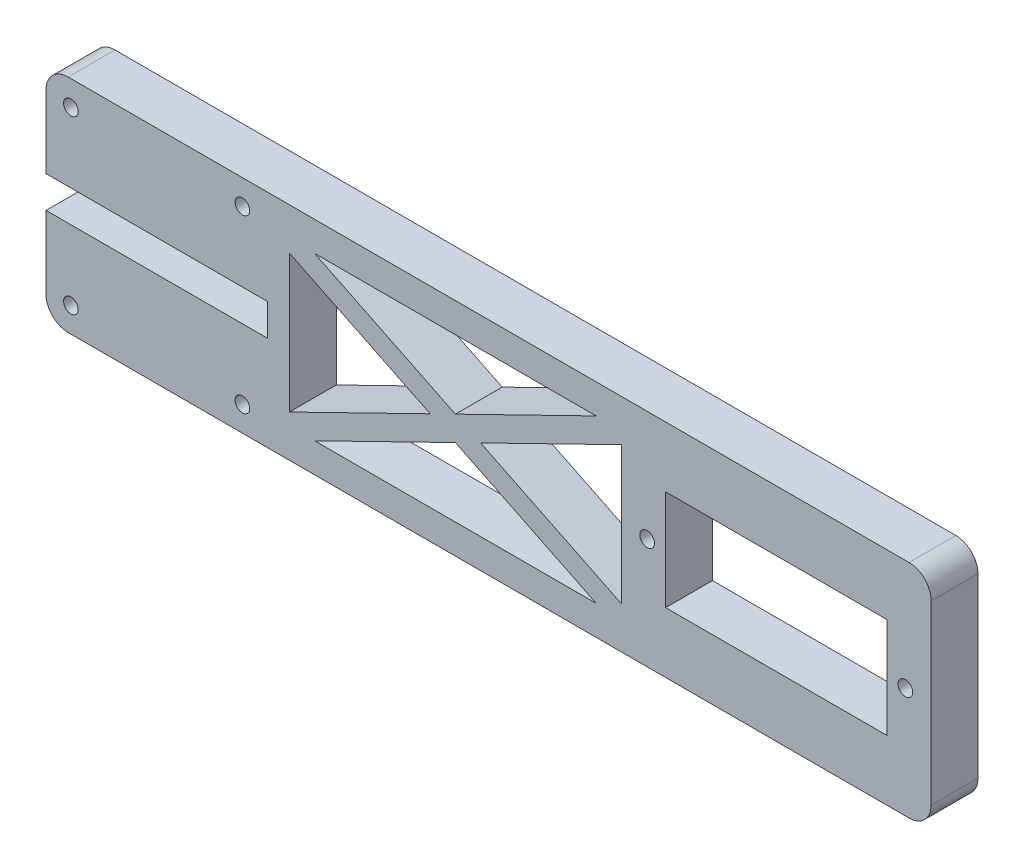
ISO-10303-21;
HEADER;
FILE_DESCRIPTION(('STEP AP214'),'2;1');
FILE_NAME('part.step','',(''),(''),'','','');
FILE_SCHEMA(('AUTOMOTIVE_DESIGN { 1 0 10303 214 1 1 1 1 }'));
ENDSEC;
DATA;
#1=APPLICATION_CONTEXT('core data for automotive mechanical design processes');
#2=APPLICATION_PROTOCOL_DEFINITION('international standard','automotive_design',2000,#1);
#3=PRODUCT_CONTEXT('',#1,'mechanical');
#4=PRODUCT('Part','Part','',(#3));
#5=PRODUCT_RELATED_PRODUCT_CATEGORY('part','',(#4));
#6=PRODUCT_DEFINITION_FORMATION('','',#4);
#7=PRODUCT_DEFINITION_CONTEXT('part definition',#1,'design');
#8=PRODUCT_DEFINITION('design','',#6,#7);
#9=PRODUCT_DEFINITION_SHAPE('','',#8);
#10=(LENGTH_UNIT() NAMED_UNIT(*) SI_UNIT(.MILLI.,.METRE.));
#11=(NAMED_UNIT(*) PLANE_ANGLE_UNIT() SI_UNIT($,.RADIAN.));
#12=(NAMED_UNIT(*) SI_UNIT($,.STERADIAN.) SOLID_ANGLE_UNIT());
#13=UNCERTAINTY_MEASURE_WITH_UNIT(LENGTH_MEASURE(1.E-05),#10,'distance_accuracy_value','');
#14=(GEOMETRIC_REPRESENTATION_CONTEXT(3) GLOBAL_UNCERTAINTY_ASSIGNED_CONTEXT((#13)) GLOBAL_UNIT_ASSIGNED_CONTEXT((#10,
#11,#12)) REPRESENTATION_CONTEXT('',''));
#15=CARTESIAN_POINT('',(0.,0.,0.));
#16=DIRECTION('',(0.,0.,1.));
#17=DIRECTION('',(1.,0.,0.));
#18=AXIS2_PLACEMENT_3D('',#15,#16,#17);
#19=CARTESIAN_POINT('',(0.,0.,6.35));
#20=DIRECTION('',(0.,0.,1.));
#21=DIRECTION('',(1.,0.,0.));
#22=AXIS2_PLACEMENT_3D('',#19,#20,#21);
#23=PLANE('',#22);
#24=DIRECTION('',(0.898384360919201,0.439210132004943,0.));
#25=VECTOR('',#24,1.);
#26=CARTESIAN_POINT('',(33.,5.66966397151576,6.35));
#27=LINE('',#26,#25);
#28=CARTESIAN_POINT('',(33.,5.66966397151576,6.35));
#29=VERTEX_POINT('',#28);
#30=CARTESIAN_POINT('',(52.0847782400814,15.,6.35));
#31=VERTEX_POINT('',#30);
#32=EDGE_CURVE('E251',#29,#31,#27,.T.);
#33=ORIENTED_EDGE('',*,*,#32,.F.);
#34=DIRECTION('',(0.,-1.,0.));
#35=VECTOR('',#34,1.);
#36=CARTESIAN_POINT('',(33.,24.3303360284842,6.35));
#37=LINE('',#36,#35);
#38=CARTESIAN_POINT('',(33.,24.3303360284842,6.35));
#39=VERTEX_POINT('',#38);
#40=EDGE_CURVE('E249',#39,#29,#37,.T.);
#41=ORIENTED_EDGE('',*,*,#40,.F.);
#42=DIRECTION('',(-0.898384360919201,0.439210132004943,0.));
#43=VECTOR('',#42,1.);
#44=CARTESIAN_POINT('',(33.,24.3303360284842,6.35));
#45=LINE('',#44,#43);
#46=EDGE_CURVE('E255',#31,#39,#45,.T.);
#47=ORIENTED_EDGE('',*,*,#46,.F.);
#48=EDGE_LOOP('',(#33,#41,#47));
#49=FACE_BOUND('',#48,.T.);
#50=DIRECTION('',(0.898384360919201,-0.439210132004943,0.));
#51=VECTOR('',#50,1.);
#52=CARTESIAN_POINT('',(36.4152217599186,26.,6.35));
#53=LINE('',#52,#51);
#54=CARTESIAN_POINT('',(36.4152217599186,26.,6.35));
#55=VERTEX_POINT('',#54);
#56=CARTESIAN_POINT('',(55.5,16.6696639715158,6.35));
#57=VERTEX_POINT('',#56);
#58=EDGE_CURVE('E299',#55,#57,#53,.T.);
#59=ORIENTED_EDGE('',*,*,#58,.F.);
#60=DIRECTION('',(-1.,0.,0.));
#61=VECTOR('',#60,1.);
#62=CARTESIAN_POINT('',(36.4152217599186,26.,6.35));
#63=LINE('',#62,#61);
#64=CARTESIAN_POINT('',(74.5847782400814,26.,6.35));
#65=VERTEX_POINT('',#64);
#66=EDGE_CURVE('E297',#65,#55,#63,.T.);
#67=ORIENTED_EDGE('',*,*,#66,.F.);
#68=DIRECTION('',(0.898384360919201,0.439210132004943,0.));
#69=VECTOR('',#68,1.);
#70=CARTESIAN_POINT('',(55.5,16.6696639715158,6.35));
#71=LINE('',#70,#69);
#72=EDGE_CURVE('E303',#57,#65,#71,.T.);
#73=ORIENTED_EDGE('',*,*,#72,.F.);
#74=EDGE_LOOP('',(#59,#67,#73));
#75=FACE_BOUND('',#74,.T.);
#76=CARTESIAN_POINT('',(81.5,15.,6.35));
#77=DIRECTION('',(0.,0.,1.));
#78=DIRECTION('',(1.,0.,0.));
#79=AXIS2_PLACEMENT_3D('',#76,#77,#78);
#80=CIRCLE('',#79,0.996949999999996);
#81=CARTESIAN_POINT('',(82.49695,15.,6.35));
#82=VERTEX_POINT('',#81);
#83=EDGE_CURVE('E320',#82,#82,#80,.T.);
#84=ORIENTED_EDGE('',*,*,#83,.F.);
#85=EDGE_LOOP('',(#84));
#86=FACE_BOUND('',#85,.T.);
#87=CARTESIAN_POINT('',(116.5,15.,6.35));
#88=DIRECTION('',(0.,0.,1.));
#89=DIRECTION('',(1.,0.,0.));
#90=AXIS2_PLACEMENT_3D('',#87,#88,#89);
#91=CIRCLE('',#90,0.996949999999996);
#92=CARTESIAN_POINT('',(117.49695,15.,6.35));
#93=VERTEX_POINT('',#92);
#94=EDGE_CURVE('E324',#93,#93,#91,.T.);
#95=ORIENTED_EDGE('',*,*,#94,.F.);
#96=EDGE_LOOP('',(#95));
#97=FACE_BOUND('',#96,.T.);
#98=CARTESIAN_POINT('',(26.625,26.625,6.35));
#99=DIRECTION('',(0.,0.,1.));
#100=DIRECTION('',(1.,0.,0.));
#101=AXIS2_PLACEMENT_3D('',#98,#99,#100);
#102=CIRCLE('',#101,0.99695);
#103=CARTESIAN_POINT('',(27.62195,26.625,6.35));
#104=VERTEX_POINT('',#103);
#105=EDGE_CURVE('E328',#104,#104,#102,.T.);
#106=ORIENTED_EDGE('',*,*,#105,.F.);
#107=EDGE_LOOP('',(#106));
#108=FACE_BOUND('',#107,.T.);
#109=CARTESIAN_POINT('',(26.625,3.37500000000001,6.35));
#110=DIRECTION('',(0.,0.,1.));
#111=DIRECTION('',(1.,0.,0.));
#112=AXIS2_PLACEMENT_3D('',#109,#110,#111);
#113=CIRCLE('',#112,0.99695);
#114=CARTESIAN_POINT('',(27.62195,3.37500000000001,6.35));
#115=VERTEX_POINT('',#114);
#116=EDGE_CURVE('E334',#115,#115,#113,.T.);
#117=ORIENTED_EDGE('',*,*,#116,.F.);
#118=EDGE_LOOP('',(#117));
#119=FACE_BOUND('',#118,.T.);
#120=CARTESIAN_POINT('',(3.375,3.37500000000001,6.35));
#121=DIRECTION('',(0.,0.,1.));
#122=DIRECTION('',(1.,0.,0.));
#123=AXIS2_PLACEMENT_3D('',#120,#121,#122);
#124=CIRCLE('',#123,0.996949999999999);
#125=CARTESIAN_POINT('',(4.37195,3.37500000000001,6.35));
#126=VERTEX_POINT('',#125);
#127=EDGE_CURVE('E338',#126,#126,#124,.T.);
#128=ORIENTED_EDGE('',*,*,#127,.F.);
#129=EDGE_LOOP('',(#128));
#130=FACE_BOUND('',#129,.T.);
#131=CARTESIAN_POINT('',(3.37500000000001,26.625,6.35));
#132=DIRECTION('',(0.,0.,1.));
#133=DIRECTION('',(1.,0.,0.));
#134=AXIS2_PLACEMENT_3D('',#131,#132,#133);
#135=CIRCLE('',#134,0.996949999999999);
#136=CARTESIAN_POINT('',(4.37195000000001,26.625,6.35));
#137=VERTEX_POINT('',#136);
#138=EDGE_CURVE('E342',#137,#137,#135,.T.);
#139=ORIENTED_EDGE('',*,*,#138,.F.);
#140=EDGE_LOOP('',(#139));
#141=FACE_BOUND('',#140,.T.);
#142=DIRECTION('',(1.,0.,0.));
#143=VECTOR('',#142,1.);
#144=CARTESIAN_POINT('',(0.,0.,6.35));
#145=LINE('',#144,#143);
#146=CARTESIAN_POINT('',(3.,0.,6.35));
#147=VERTEX_POINT('',#146);
#148=CARTESIAN_POINT('',(117.,0.,6.35));
#149=VERTEX_POINT('',#148);
#150=EDGE_CURVE('E381',#147,#149,#145,.T.);
#151=ORIENTED_EDGE('',*,*,#150,.T.);
#152=CARTESIAN_POINT('',(117.,3.,6.35));
#153=DIRECTION('',(0.,0.,1.));
#154=DIRECTION('',(1.,0.,0.));
#155=AXIS2_PLACEMENT_3D('',#152,#153,#154);
#156=CIRCLE('',#155,3.);
#157=CARTESIAN_POINT('',(120.,3.,6.35));
#158=VERTEX_POINT('',#157);
#159=EDGE_CURVE('E463',#149,#158,#156,.T.);
#160=ORIENTED_EDGE('',*,*,#159,.T.);
#161=DIRECTION('',(0.,1.,0.));
#162=VECTOR('',#161,1.);
#163=CARTESIAN_POINT('',(120.,30.,6.35));
#164=LINE('',#163,#162);
#165=CARTESIAN_POINT('',(120.,27.,6.35));
#166=VERTEX_POINT('',#165);
#167=EDGE_CURVE('E385',#158,#166,#164,.T.);
#168=ORIENTED_EDGE('',*,*,#167,.T.);
#169=CARTESIAN_POINT('',(117.,27.,6.35));
#170=DIRECTION('',(0.,0.,1.));
#171=DIRECTION('',(1.,0.,0.));
#172=AXIS2_PLACEMENT_3D('',#169,#170,#171);
#173=CIRCLE('',#172,3.);
#174=CARTESIAN_POINT('',(117.,30.,6.35));
#175=VERTEX_POINT('',#174);
#176=EDGE_CURVE('E461',#166,#175,#173,.T.);
#177=ORIENTED_EDGE('',*,*,#176,.T.);
#178=DIRECTION('',(-1.,0.,0.));
#179=VECTOR('',#178,1.);
#180=CARTESIAN_POINT('',(120.,30.,6.35));
#181=LINE('',#180,#179);
#182=CARTESIAN_POINT('',(3.,30.,6.35));
#183=VERTEX_POINT('',#182);
#184=EDGE_CURVE('E388',#175,#183,#181,.T.);
#185=ORIENTED_EDGE('',*,*,#184,.T.);
#186=CARTESIAN_POINT('',(3.,27.,6.35));
#187=DIRECTION('',(0.,0.,1.));
#188=DIRECTION('',(1.,0.,0.));
#189=AXIS2_PLACEMENT_3D('',#186,#187,#188);
#190=CIRCLE('',#189,3.);
#191=CARTESIAN_POINT('',(0.,27.,6.35));
#192=VERTEX_POINT('',#191);
#193=EDGE_CURVE('E457',#183,#192,#190,.T.);
#194=ORIENTED_EDGE('',*,*,#193,.T.);
#195=DIRECTION('',(0.,-1.,0.));
#196=VECTOR('',#195,1.);
#197=CARTESIAN_POINT('',(0.,30.,6.35));
#198=LINE('',#197,#196);
#199=CARTESIAN_POINT('',(0.,17.159,6.35));
#200=VERTEX_POINT('',#199);
#201=EDGE_CURVE('E391',#192,#200,#198,.T.);
#202=ORIENTED_EDGE('',*,*,#201,.T.);
#203=DIRECTION('',(1.,0.,0.));
#204=VECTOR('',#203,1.);
#205=CARTESIAN_POINT('',(0.,17.159,6.35));
#206=LINE('',#205,#204);
#207=CARTESIAN_POINT('',(30.,17.159,6.35));
#208=VERTEX_POINT('',#207);
#209=EDGE_CURVE('E393',#200,#208,#206,.T.);
#210=ORIENTED_EDGE('',*,*,#209,.T.);
#211=DIRECTION('',(0.,-1.,0.));
#212=VECTOR('',#211,1.);
#213=CARTESIAN_POINT('',(30.,17.159,6.35));
#214=LINE('',#213,#212);
#215=CARTESIAN_POINT('',(30.,12.841,6.35));
#216=VERTEX_POINT('',#215);
#217=EDGE_CURVE('E395',#208,#216,#214,.T.);
#218=ORIENTED_EDGE('',*,*,#217,.T.);
#219=DIRECTION('',(-1.,0.,0.));
#220=VECTOR('',#219,1.);
#221=CARTESIAN_POINT('',(0.,12.841,6.35));
#222=LINE('',#221,#220);
#223=CARTESIAN_POINT('',(0.,12.841,6.35));
#224=VERTEX_POINT('',#223);
#225=EDGE_CURVE('E397',#216,#224,#222,.T.);
#226=ORIENTED_EDGE('',*,*,#225,.T.);
#227=DIRECTION('',(0.,-1.,0.));
#228=VECTOR('',#227,1.);
#229=CARTESIAN_POINT('',(0.,12.841,6.35));
#230=LINE('',#229,#228);
#231=CARTESIAN_POINT('',(0.,3.,6.35));
#232=VERTEX_POINT('',#231);
#233=EDGE_CURVE('E378',#224,#232,#230,.T.);
#234=ORIENTED_EDGE('',*,*,#233,.T.);
#235=CARTESIAN_POINT('',(3.,3.,6.35));
#236=DIRECTION('',(0.,0.,1.));
#237=DIRECTION('',(1.,0.,0.));
#238=AXIS2_PLACEMENT_3D('',#235,#236,#237);
#239=CIRCLE('',#238,3.);
#240=EDGE_CURVE('E459',#232,#147,#239,.T.);
#241=ORIENTED_EDGE('',*,*,#240,.T.);
#242=EDGE_LOOP('',(#151,#160,#168,#177,#185,#194,#202,#210,#218,#226,#234,#241));
#243=FACE_BOUND('',#242,.T.);
#244=DIRECTION('',(1.,0.,0.));
#245=VECTOR('',#244,1.);
#246=CARTESIAN_POINT('',(84.,8.2,6.35));
#247=LINE('',#246,#245);
#248=CARTESIAN_POINT('',(84.,8.2,6.35));
#249=VERTEX_POINT('',#248);
#250=CARTESIAN_POINT('',(114.,8.2,6.35));
#251=VERTEX_POINT('',#250);
#252=EDGE_CURVE('E348',#249,#251,#247,.T.);
#253=ORIENTED_EDGE('',*,*,#252,.F.);
#254=DIRECTION('',(0.,-1.,0.));
#255=VECTOR('',#254,1.);
#256=CARTESIAN_POINT('',(84.,21.8,6.35));
#257=LINE('',#256,#255);
#258=CARTESIAN_POINT('',(84.,21.8,6.35));
#259=VERTEX_POINT('',#258);
#260=EDGE_CURVE('E346',#259,#249,#257,.T.);
#261=ORIENTED_EDGE('',*,*,#260,.F.);
#262=DIRECTION('',(-1.,0.,0.));
#263=VECTOR('',#262,1.);
#264=CARTESIAN_POINT('',(84.,21.8,6.35));
#265=LINE('',#264,#263);
#266=CARTESIAN_POINT('',(114.,21.8,6.35));
#267=VERTEX_POINT('',#266);
#268=EDGE_CURVE('E354',#267,#259,#265,.T.);
#269=ORIENTED_EDGE('',*,*,#268,.F.);
#270=DIRECTION('',(0.,1.,0.));
#271=VECTOR('',#270,1.);
#272=CARTESIAN_POINT('',(114.,21.8,6.35));
#273=LINE('',#272,#271);
#274=EDGE_CURVE('E351',#251,#267,#273,.T.);
#275=ORIENTED_EDGE('',*,*,#274,.F.);
#276=EDGE_LOOP('',(#253,#261,#269,#275));
#277=FACE_BOUND('',#276,.T.);
#278=DIRECTION('',(0.,1.,0.));
#279=VECTOR('',#278,1.);
#280=CARTESIAN_POINT('',(78.,24.3303360284842,6.35));
#281=LINE('',#280,#279);
#282=CARTESIAN_POINT('',(78.,5.66966397151576,6.35));
#283=VERTEX_POINT('',#282);
#284=CARTESIAN_POINT('',(78.,24.3303360284842,6.35));
#285=VERTEX_POINT('',#284);
#286=EDGE_CURVE('E275',#283,#285,#281,.T.);
#287=ORIENTED_EDGE('',*,*,#286,.F.);
#288=DIRECTION('',(0.898384360919201,-0.439210132004943,0.));
#289=VECTOR('',#288,1.);
#290=CARTESIAN_POINT('',(58.9152217599186,15.,6.35));
#291=LINE('',#290,#289);
#292=CARTESIAN_POINT('',(58.9152217599186,15.,6.35));
#293=VERTEX_POINT('',#292);
#294=EDGE_CURVE('E273',#293,#283,#291,.T.);
#295=ORIENTED_EDGE('',*,*,#294,.F.);
#296=DIRECTION('',(-0.898384360919201,-0.439210132004943,0.));
#297=VECTOR('',#296,1.);
#298=CARTESIAN_POINT('',(58.9152217599186,15.,6.35));
#299=LINE('',#298,#297);
#300=EDGE_CURVE('E279',#285,#293,#299,.T.);
#301=ORIENTED_EDGE('',*,*,#300,.F.);
#302=EDGE_LOOP('',(#287,#295,#301));
#303=FACE_BOUND('',#302,.T.);
#304=DIRECTION('',(-0.898384360919201,-0.439210132004943,0.));
#305=VECTOR('',#304,1.);
#306=CARTESIAN_POINT('',(36.4152217599186,4.00000000000001,6.35));
#307=LINE('',#306,#305);
#308=CARTESIAN_POINT('',(55.5,13.3303360284842,6.35));
#309=VERTEX_POINT('',#308);
#310=CARTESIAN_POINT('',(36.4152217599186,4.00000000000001,6.35));
#311=VERTEX_POINT('',#310);
#312=EDGE_CURVE('E230',#309,#311,#307,.T.);
#313=ORIENTED_EDGE('',*,*,#312,.F.);
#314=DIRECTION('',(-0.898384360919201,0.439210132004943,0.));
#315=VECTOR('',#314,1.);
#316=CARTESIAN_POINT('',(55.5,13.3303360284842,6.35));
#317=LINE('',#316,#315);
#318=CARTESIAN_POINT('',(74.5847782400814,4.00000000000001,6.35));
#319=VERTEX_POINT('',#318);
#320=EDGE_CURVE('E222',#319,#309,#317,.T.);
#321=ORIENTED_EDGE('',*,*,#320,.F.);
#322=DIRECTION('',(1.,0.,0.));
#323=VECTOR('',#322,1.);
#324=CARTESIAN_POINT('',(36.4152217599186,4.00000000000001,6.35));
#325=LINE('',#324,#323);
#326=EDGE_CURVE('E239',#311,#319,#325,.T.);
#327=ORIENTED_EDGE('',*,*,#326,.F.);
#328=EDGE_LOOP('',(#313,#321,#327));
#329=FACE_BOUND('',#328,.T.);
#330=ADVANCED_FACE('F37',(#49,#75,#86,#97,#108,#119,#130,#141,#243,#277,#303,#329),#23,.T.);
#331=CARTESIAN_POINT('',(0.,0.,0.));
#332=DIRECTION('',(0.,0.,1.));
#333=DIRECTION('',(1.,0.,0.));
#334=AXIS2_PLACEMENT_3D('',#331,#332,#333);
#335=PLANE('',#334);
#336=DIRECTION('',(0.,-1.,0.));
#337=VECTOR('',#336,1.);
#338=CARTESIAN_POINT('',(33.,24.3303360284842,0.));
#339=LINE('',#338,#337);
#340=CARTESIAN_POINT('',(33.,24.3303360284842,0.));
#341=VERTEX_POINT('',#340);
#342=CARTESIAN_POINT('',(33.,5.66966397151576,0.));
#343=VERTEX_POINT('',#342);
#344=EDGE_CURVE('E237',#341,#343,#339,.T.);
#345=ORIENTED_EDGE('',*,*,#344,.T.);
#346=DIRECTION('',(0.898384360919201,0.439210132004943,0.));
#347=VECTOR('',#346,1.);
#348=CARTESIAN_POINT('',(33.,5.66966397151576,0.));
#349=LINE('',#348,#347);
#350=CARTESIAN_POINT('',(52.0847782400814,15.,0.));
#351=VERTEX_POINT('',#350);
#352=EDGE_CURVE('E260',#343,#351,#349,.T.);
#353=ORIENTED_EDGE('',*,*,#352,.T.);
#354=DIRECTION('',(-0.898384360919201,0.439210132004943,0.));
#355=VECTOR('',#354,1.);
#356=CARTESIAN_POINT('',(33.,24.3303360284842,0.));
#357=LINE('',#356,#355);
#358=EDGE_CURVE('E252',#351,#341,#357,.T.);
#359=ORIENTED_EDGE('',*,*,#358,.T.);
#360=EDGE_LOOP('',(#345,#353,#359));
#361=FACE_BOUND('',#360,.T.);
#362=DIRECTION('',(-1.,0.,0.));
#363=VECTOR('',#362,1.);
#364=CARTESIAN_POINT('',(36.4152217599186,26.,0.));
#365=LINE('',#364,#363);
#366=CARTESIAN_POINT('',(74.5847782400814,26.,0.));
#367=VERTEX_POINT('',#366);
#368=CARTESIAN_POINT('',(36.4152217599186,26.,0.));
#369=VERTEX_POINT('',#368);
#370=EDGE_CURVE('E296',#367,#369,#365,.T.);
#371=ORIENTED_EDGE('',*,*,#370,.T.);
#372=DIRECTION('',(0.898384360919201,-0.439210132004943,0.));
#373=VECTOR('',#372,1.);
#374=CARTESIAN_POINT('',(36.4152217599186,26.,0.));
#375=LINE('',#374,#373);
#376=CARTESIAN_POINT('',(55.5,16.6696639715158,0.));
#377=VERTEX_POINT('',#376);
#378=EDGE_CURVE('E308',#369,#377,#375,.T.);
#379=ORIENTED_EDGE('',*,*,#378,.T.);
#380=DIRECTION('',(0.898384360919201,0.439210132004943,0.));
#381=VECTOR('',#380,1.);
#382=CARTESIAN_POINT('',(55.5,16.6696639715158,0.));
#383=LINE('',#382,#381);
#384=EDGE_CURVE('E300',#377,#367,#383,.T.);
#385=ORIENTED_EDGE('',*,*,#384,.T.);
#386=EDGE_LOOP('',(#371,#379,#385));
#387=FACE_BOUND('',#386,.T.);
#388=CARTESIAN_POINT('',(81.5,15.,0.));
#389=DIRECTION('',(0.,0.,1.));
#390=DIRECTION('',(1.,0.,0.));
#391=AXIS2_PLACEMENT_3D('',#388,#389,#390);
#392=CIRCLE('',#391,0.996949999999996);
#393=CARTESIAN_POINT('',(82.49695,15.,0.));
#394=VERTEX_POINT('',#393);
#395=EDGE_CURVE('E323',#394,#394,#392,.T.);
#396=ORIENTED_EDGE('',*,*,#395,.T.);
#397=EDGE_LOOP('',(#396));
#398=FACE_BOUND('',#397,.T.);
#399=CARTESIAN_POINT('',(116.5,15.,0.));
#400=DIRECTION('',(0.,0.,1.));
#401=DIRECTION('',(1.,0.,0.));
#402=AXIS2_PLACEMENT_3D('',#399,#400,#401);
#403=CIRCLE('',#402,0.996949999999996);
#404=CARTESIAN_POINT('',(117.49695,15.,0.));
#405=VERTEX_POINT('',#404);
#406=EDGE_CURVE('E327',#405,#405,#403,.T.);
#407=ORIENTED_EDGE('',*,*,#406,.T.);
#408=EDGE_LOOP('',(#407));
#409=FACE_BOUND('',#408,.T.);
#410=CARTESIAN_POINT('',(26.625,26.625,0.));
#411=DIRECTION('',(0.,0.,1.));
#412=DIRECTION('',(1.,0.,0.));
#413=AXIS2_PLACEMENT_3D('',#410,#411,#412);
#414=CIRCLE('',#413,0.996949999999998);
#415=CARTESIAN_POINT('',(27.62195,26.625,0.));
#416=VERTEX_POINT('',#415);
#417=EDGE_CURVE('E331',#416,#416,#414,.T.);
#418=ORIENTED_EDGE('',*,*,#417,.T.);
#419=EDGE_LOOP('',(#418));
#420=FACE_BOUND('',#419,.T.);
#421=CARTESIAN_POINT('',(26.625,3.37500000000001,0.));
#422=DIRECTION('',(0.,0.,1.));
#423=DIRECTION('',(1.,0.,0.));
#424=AXIS2_PLACEMENT_3D('',#421,#422,#423);
#425=CIRCLE('',#424,0.996949999999998);
#426=CARTESIAN_POINT('',(27.62195,3.37500000000001,0.));
#427=VERTEX_POINT('',#426);
#428=EDGE_CURVE('E337',#427,#427,#425,.T.);
#429=ORIENTED_EDGE('',*,*,#428,.T.);
#430=EDGE_LOOP('',(#429));
#431=FACE_BOUND('',#430,.T.);
#432=CARTESIAN_POINT('',(3.375,3.37500000000001,0.));
#433=DIRECTION('',(0.,0.,1.));
#434=DIRECTION('',(1.,0.,0.));
#435=AXIS2_PLACEMENT_3D('',#432,#433,#434);
#436=CIRCLE('',#435,0.996949999999999);
#437=CARTESIAN_POINT('',(4.37195,3.37500000000001,0.));
#438=VERTEX_POINT('',#437);
#439=EDGE_CURVE('E341',#438,#438,#436,.T.);
#440=ORIENTED_EDGE('',*,*,#439,.T.);
#441=EDGE_LOOP('',(#440));
#442=FACE_BOUND('',#441,.T.);
#443=CARTESIAN_POINT('',(3.37500000000001,26.625,0.));
#444=DIRECTION('',(0.,0.,1.));
#445=DIRECTION('',(1.,0.,0.));
#446=AXIS2_PLACEMENT_3D('',#443,#444,#445);
#447=CIRCLE('',#446,0.996949999999999);
#448=CARTESIAN_POINT('',(4.37195000000001,26.625,0.));
#449=VERTEX_POINT('',#448);
#450=EDGE_CURVE('E345',#449,#449,#447,.T.);
#451=ORIENTED_EDGE('',*,*,#450,.T.);
#452=EDGE_LOOP('',(#451));
#453=FACE_BOUND('',#452,.T.);
#454=DIRECTION('',(0.,1.,0.));
#455=VECTOR('',#454,1.);
#456=CARTESIAN_POINT('',(120.,30.,0.));
#457=LINE('',#456,#455);
#458=CARTESIAN_POINT('',(120.,3.,0.));
#459=VERTEX_POINT('',#458);
#460=CARTESIAN_POINT('',(120.,27.,0.));
#461=VERTEX_POINT('',#460);
#462=EDGE_CURVE('E405',#459,#461,#457,.T.);
#463=ORIENTED_EDGE('',*,*,#462,.F.);
#464=CARTESIAN_POINT('',(117.,3.,0.));
#465=DIRECTION('',(0.,0.,1.));
#466=DIRECTION('',(1.,0.,0.));
#467=AXIS2_PLACEMENT_3D('',#464,#465,#466);
#468=CIRCLE('',#467,3.);
#469=CARTESIAN_POINT('',(117.,0.,0.));
#470=VERTEX_POINT('',#469);
#471=EDGE_CURVE('E450',#459,#470,#468,.F.);
#472=ORIENTED_EDGE('',*,*,#471,.T.);
#473=DIRECTION('',(1.,0.,0.));
#474=VECTOR('',#473,1.);
#475=CARTESIAN_POINT('',(0.,0.,0.));
#476=LINE('',#475,#474);
#477=CARTESIAN_POINT('',(3.,0.,0.));
#478=VERTEX_POINT('',#477);
#479=EDGE_CURVE('E402',#478,#470,#476,.T.);
#480=ORIENTED_EDGE('',*,*,#479,.F.);
#481=CARTESIAN_POINT('',(3.,3.,0.));
#482=DIRECTION('',(0.,0.,1.));
#483=DIRECTION('',(1.,0.,0.));
#484=AXIS2_PLACEMENT_3D('',#481,#482,#483);
#485=CIRCLE('',#484,3.);
#486=CARTESIAN_POINT('',(0.,3.,0.));
#487=VERTEX_POINT('',#486);
#488=EDGE_CURVE('E446',#478,#487,#485,.F.);
#489=ORIENTED_EDGE('',*,*,#488,.T.);
#490=DIRECTION('',(0.,-1.,0.));
#491=VECTOR('',#490,1.);
#492=CARTESIAN_POINT('',(0.,12.841,0.));
#493=LINE('',#492,#491);
#494=CARTESIAN_POINT('',(0.,12.841,0.));
#495=VERTEX_POINT('',#494);
#496=EDGE_CURVE('E377',#495,#487,#493,.T.);
#497=ORIENTED_EDGE('',*,*,#496,.F.);
#498=DIRECTION('',(-1.,0.,0.));
#499=VECTOR('',#498,1.);
#500=CARTESIAN_POINT('',(0.,12.841,0.));
#501=LINE('',#500,#499);
#502=CARTESIAN_POINT('',(30.,12.841,0.));
#503=VERTEX_POINT('',#502);
#504=EDGE_CURVE('E382',#503,#495,#501,.T.);
#505=ORIENTED_EDGE('',*,*,#504,.F.);
#506=DIRECTION('',(0.,-1.,0.));
#507=VECTOR('',#506,1.);
#508=CARTESIAN_POINT('',(30.,17.159,0.));
#509=LINE('',#508,#507);
#510=CARTESIAN_POINT('',(30.,17.159,0.));
#511=VERTEX_POINT('',#510);
#512=EDGE_CURVE('E415',#511,#503,#509,.T.);
#513=ORIENTED_EDGE('',*,*,#512,.F.);
#514=DIRECTION('',(1.,0.,0.));
#515=VECTOR('',#514,1.);
#516=CARTESIAN_POINT('',(0.,17.159,0.));
#517=LINE('',#516,#515);
#518=CARTESIAN_POINT('',(0.,17.159,0.));
#519=VERTEX_POINT('',#518);
#520=EDGE_CURVE('E413',#519,#511,#517,.T.);
#521=ORIENTED_EDGE('',*,*,#520,.F.);
#522=DIRECTION('',(0.,-1.,0.));
#523=VECTOR('',#522,1.);
#524=CARTESIAN_POINT('',(0.,30.,0.));
#525=LINE('',#524,#523);
#526=CARTESIAN_POINT('',(0.,27.,0.));
#527=VERTEX_POINT('',#526);
#528=EDGE_CURVE('E411',#527,#519,#525,.T.);
#529=ORIENTED_EDGE('',*,*,#528,.F.);
#530=CARTESIAN_POINT('',(3.,27.,0.));
#531=DIRECTION('',(0.,0.,1.));
#532=DIRECTION('',(1.,0.,0.));
#533=AXIS2_PLACEMENT_3D('',#530,#531,#532);
#534=CIRCLE('',#533,3.);
#535=CARTESIAN_POINT('',(3.,30.,0.));
#536=VERTEX_POINT('',#535);
#537=EDGE_CURVE('E444',#527,#536,#534,.F.);
#538=ORIENTED_EDGE('',*,*,#537,.T.);
#539=DIRECTION('',(-1.,0.,0.));
#540=VECTOR('',#539,1.);
#541=CARTESIAN_POINT('',(120.,30.,0.));
#542=LINE('',#541,#540);
#543=CARTESIAN_POINT('',(117.,30.,0.));
#544=VERTEX_POINT('',#543);
#545=EDGE_CURVE('E408',#544,#536,#542,.T.);
#546=ORIENTED_EDGE('',*,*,#545,.F.);
#547=CARTESIAN_POINT('',(117.,27.,0.));
#548=DIRECTION('',(0.,0.,1.));
#549=DIRECTION('',(1.,0.,0.));
#550=AXIS2_PLACEMENT_3D('',#547,#548,#549);
#551=CIRCLE('',#550,3.);
#552=EDGE_CURVE('E448',#544,#461,#551,.F.);
#553=ORIENTED_EDGE('',*,*,#552,.T.);
#554=EDGE_LOOP('',(#463,#472,#480,#489,#497,#505,#513,#521,#529,#538,#546,#553));
#555=FACE_BOUND('',#554,.T.);
#556=DIRECTION('',(0.,-1.,0.));
#557=VECTOR('',#556,1.);
#558=CARTESIAN_POINT('',(84.,21.8,0.));
#559=LINE('',#558,#557);
#560=CARTESIAN_POINT('',(84.,21.8,0.));
#561=VERTEX_POINT('',#560);
#562=CARTESIAN_POINT('',(84.,8.2,0.));
#563=VERTEX_POINT('',#562);
#564=EDGE_CURVE('E357',#561,#563,#559,.T.);
#565=ORIENTED_EDGE('',*,*,#564,.T.);
#566=DIRECTION('',(1.,0.,0.));
#567=VECTOR('',#566,1.);
#568=CARTESIAN_POINT('',(84.,8.2,0.));
#569=LINE('',#568,#567);
#570=CARTESIAN_POINT('',(114.,8.2,0.));
#571=VERTEX_POINT('',#570);
#572=EDGE_CURVE('E360',#563,#571,#569,.T.);
#573=ORIENTED_EDGE('',*,*,#572,.T.);
#574=DIRECTION('',(0.,1.,0.));
#575=VECTOR('',#574,1.);
#576=CARTESIAN_POINT('',(114.,21.8,0.));
#577=LINE('',#576,#575);
#578=CARTESIAN_POINT('',(114.,21.8,0.));
#579=VERTEX_POINT('',#578);
#580=EDGE_CURVE('E363',#571,#579,#577,.T.);
#581=ORIENTED_EDGE('',*,*,#580,.T.);
#582=DIRECTION('',(-1.,0.,0.));
#583=VECTOR('',#582,1.);
#584=CARTESIAN_POINT('',(84.,21.8,0.));
#585=LINE('',#584,#583);
#586=EDGE_CURVE('E349',#579,#561,#585,.T.);
#587=ORIENTED_EDGE('',*,*,#586,.T.);
#588=EDGE_LOOP('',(#565,#573,#581,#587));
#589=FACE_BOUND('',#588,.T.);
#590=DIRECTION('',(0.898384360919201,-0.439210132004943,0.));
#591=VECTOR('',#590,1.);
#592=CARTESIAN_POINT('',(58.9152217599186,15.,0.));
#593=LINE('',#592,#591);
#594=CARTESIAN_POINT('',(58.9152217599186,15.,0.));
#595=VERTEX_POINT('',#594);
#596=CARTESIAN_POINT('',(78.,5.66966397151576,0.));
#597=VERTEX_POINT('',#596);
#598=EDGE_CURVE('E272',#595,#597,#593,.T.);
#599=ORIENTED_EDGE('',*,*,#598,.T.);
#600=DIRECTION('',(0.,1.,0.));
#601=VECTOR('',#600,1.);
#602=CARTESIAN_POINT('',(78.,24.3303360284842,0.));
#603=LINE('',#602,#601);
#604=CARTESIAN_POINT('',(78.,24.3303360284842,0.));
#605=VERTEX_POINT('',#604);
#606=EDGE_CURVE('E284',#597,#605,#603,.T.);
#607=ORIENTED_EDGE('',*,*,#606,.T.);
#608=DIRECTION('',(-0.898384360919201,-0.439210132004943,0.));
#609=VECTOR('',#608,1.);
#610=CARTESIAN_POINT('',(58.9152217599186,15.,0.));
#611=LINE('',#610,#609);
#612=EDGE_CURVE('E276',#605,#595,#611,.T.);
#613=ORIENTED_EDGE('',*,*,#612,.T.);
#614=EDGE_LOOP('',(#599,#607,#613));
#615=FACE_BOUND('',#614,.T.);
#616=DIRECTION('',(-0.898384360919201,0.439210132004943,0.));
#617=VECTOR('',#616,1.);
#618=CARTESIAN_POINT('',(55.5,13.3303360284842,0.));
#619=LINE('',#618,#617);
#620=CARTESIAN_POINT('',(74.5847782400814,4.00000000000001,0.));
#621=VERTEX_POINT('',#620);
#622=CARTESIAN_POINT('',(55.5,13.3303360284842,0.));
#623=VERTEX_POINT('',#622);
#624=EDGE_CURVE('E60',#621,#623,#619,.T.);
#625=ORIENTED_EDGE('',*,*,#624,.T.);
#626=DIRECTION('',(-0.898384360919201,-0.439210132004943,0.));
#627=VECTOR('',#626,1.);
#628=CARTESIAN_POINT('',(36.4152217599186,4.00000000000001,0.));
#629=LINE('',#628,#627);
#630=CARTESIAN_POINT('',(36.4152217599186,4.00000000000001,0.));
#631=VERTEX_POINT('',#630);
#632=EDGE_CURVE('E236',#623,#631,#629,.T.);
#633=ORIENTED_EDGE('',*,*,#632,.T.);
#634=DIRECTION('',(1.,0.,0.));
#635=VECTOR('',#634,1.);
#636=CARTESIAN_POINT('',(36.4152217599186,4.00000000000001,0.));
#637=LINE('',#636,#635);
#638=EDGE_CURVE('E231',#631,#621,#637,.T.);
#639=ORIENTED_EDGE('',*,*,#638,.T.);
#640=EDGE_LOOP('',(#625,#633,#639));
#641=FACE_BOUND('',#640,.T.);
#642=ADVANCED_FACE('F489',(#361,#387,#398,#409,#420,#431,#442,#453,#555,#589,#615,#641),#335,.F.);
#643=CARTESIAN_POINT('',(0.,12.841,6.35));
#644=DIRECTION('',(1.,0.,0.));
#645=DIRECTION('',(0.,0.,-1.));
#646=AXIS2_PLACEMENT_3D('',#643,#644,#645);
#647=PLANE('',#646);
#648=ORIENTED_EDGE('',*,*,#496,.T.);
#649=DIRECTION('',(0.,0.,-1.));
#650=VECTOR('',#649,1.);
#651=CARTESIAN_POINT('',(0.,3.,6.35));
#652=LINE('',#651,#650);
#653=EDGE_CURVE('E45',#487,#232,#652,.F.);
#654=ORIENTED_EDGE('',*,*,#653,.T.);
#655=ORIENTED_EDGE('',*,*,#233,.F.);
#656=DIRECTION('',(0.,0.,-1.));
#657=VECTOR('',#656,1.);
#658=CARTESIAN_POINT('',(0.,12.841,6.35));
#659=LINE('',#658,#657);
#660=EDGE_CURVE('E399',#224,#495,#659,.T.);
#661=ORIENTED_EDGE('',*,*,#660,.T.);
#662=EDGE_LOOP('',(#648,#654,#655,#661));
#663=FACE_BOUND('',#662,.T.);
#664=ADVANCED_FACE('F472',(#663),#647,.F.);
#665=CARTESIAN_POINT('',(0.,0.,6.35));
#666=DIRECTION('',(0.,1.,0.));
#667=DIRECTION('',(0.,0.,1.));
#668=AXIS2_PLACEMENT_3D('',#665,#666,#667);
#669=PLANE('',#668);
#670=ORIENTED_EDGE('',*,*,#479,.T.);
#671=DIRECTION('',(0.,0.,-1.));
#672=VECTOR('',#671,1.);
#673=CARTESIAN_POINT('',(117.,0.,6.35));
#674=LINE('',#673,#672);
#675=EDGE_CURVE('E455',#470,#149,#674,.F.);
#676=ORIENTED_EDGE('',*,*,#675,.T.);
#677=ORIENTED_EDGE('',*,*,#150,.F.);
#678=DIRECTION('',(0.,0.,-1.));
#679=VECTOR('',#678,1.);
#680=CARTESIAN_POINT('',(3.,0.,6.35));
#681=LINE('',#680,#679);
#682=EDGE_CURVE('E452',#147,#478,#681,.T.);
#683=ORIENTED_EDGE('',*,*,#682,.T.);
#684=EDGE_LOOP('',(#670,#676,#677,#683));
#685=FACE_BOUND('',#684,.T.);
#686=ADVANCED_FACE('F485',(#685),#669,.F.);
#687=CARTESIAN_POINT('',(120.,30.,6.35));
#688=DIRECTION('',(-1.,0.,0.));
#689=DIRECTION('',(0.,0.,1.));
#690=AXIS2_PLACEMENT_3D('',#687,#688,#689);
#691=PLANE('',#690);
#692=ORIENTED_EDGE('',*,*,#167,.F.);
#693=DIRECTION('',(0.,0.,-1.));
#694=VECTOR('',#693,1.);
#695=CARTESIAN_POINT('',(120.,3.,6.35));
#696=LINE('',#695,#694);
#697=EDGE_CURVE('E441',#158,#459,#696,.T.);
#698=ORIENTED_EDGE('',*,*,#697,.T.);
#699=ORIENTED_EDGE('',*,*,#462,.T.);
#700=DIRECTION('',(0.,0.,-1.));
#701=VECTOR('',#700,1.);
#702=CARTESIAN_POINT('',(120.,27.,6.35));
#703=LINE('',#702,#701);
#704=EDGE_CURVE('E429',#461,#166,#703,.F.);
#705=ORIENTED_EDGE('',*,*,#704,.T.);
#706=EDGE_LOOP('',(#692,#698,#699,#705));
#707=FACE_BOUND('',#706,.T.);
#708=ADVANCED_FACE('F497',(#707),#691,.F.);
#709=CARTESIAN_POINT('',(120.,30.,6.35));
#710=DIRECTION('',(0.,-1.,0.));
#711=DIRECTION('',(1.,0.,0.));
#712=AXIS2_PLACEMENT_3D('',#709,#710,#711);
#713=PLANE('',#712);
#714=ORIENTED_EDGE('',*,*,#184,.F.);
#715=DIRECTION('',(0.,0.,-1.));
#716=VECTOR('',#715,1.);
#717=CARTESIAN_POINT('',(117.,30.,6.35));
#718=LINE('',#717,#716);
#719=EDGE_CURVE('E467',#175,#544,#718,.T.);
#720=ORIENTED_EDGE('',*,*,#719,.T.);
#721=ORIENTED_EDGE('',*,*,#545,.T.);
#722=DIRECTION('',(0.,0.,-1.));
#723=VECTOR('',#722,1.);
#724=CARTESIAN_POINT('',(3.,30.,6.35));
#725=LINE('',#724,#723);
#726=EDGE_CURVE('E465',#536,#183,#725,.F.);
#727=ORIENTED_EDGE('',*,*,#726,.T.);
#728=EDGE_LOOP('',(#714,#720,#721,#727));
#729=FACE_BOUND('',#728,.T.);
#730=ADVANCED_FACE('F506',(#729),#713,.F.);
#731=CARTESIAN_POINT('',(0.,30.,6.35));
#732=DIRECTION('',(1.,0.,0.));
#733=DIRECTION('',(0.,1.,0.));
#734=AXIS2_PLACEMENT_3D('',#731,#732,#733);
#735=PLANE('',#734);
#736=ORIENTED_EDGE('',*,*,#201,.F.);
#737=DIRECTION('',(0.,0.,-1.));
#738=VECTOR('',#737,1.);
#739=CARTESIAN_POINT('',(0.,27.,6.35));
#740=LINE('',#739,#738);
#741=EDGE_CURVE('E11',#192,#527,#740,.T.);
#742=ORIENTED_EDGE('',*,*,#741,.T.);
#743=ORIENTED_EDGE('',*,*,#528,.T.);
#744=DIRECTION('',(0.,0.,-1.));
#745=VECTOR('',#744,1.);
#746=CARTESIAN_POINT('',(0.,17.159,6.35));
#747=LINE('',#746,#745);
#748=EDGE_CURVE('E426',#200,#519,#747,.T.);
#749=ORIENTED_EDGE('',*,*,#748,.F.);
#750=EDGE_LOOP('',(#736,#742,#743,#749));
#751=FACE_BOUND('',#750,.T.);
#752=ADVANCED_FACE('F515',(#751),#735,.F.);
#753=CARTESIAN_POINT('',(0.,17.159,6.35));
#754=DIRECTION('',(0.,1.,0.));
#755=DIRECTION('',(0.,0.,1.));
#756=AXIS2_PLACEMENT_3D('',#753,#754,#755);
#757=PLANE('',#756);
#758=ORIENTED_EDGE('',*,*,#520,.T.);
#759=DIRECTION('',(0.,0.,-1.));
#760=VECTOR('',#759,1.);
#761=CARTESIAN_POINT('',(30.,17.159,6.35));
#762=LINE('',#761,#760);
#763=EDGE_CURVE('E423',#208,#511,#762,.T.);
#764=ORIENTED_EDGE('',*,*,#763,.F.);
#765=ORIENTED_EDGE('',*,*,#209,.F.);
#766=ORIENTED_EDGE('',*,*,#748,.T.);
#767=EDGE_LOOP('',(#758,#764,#765,#766));
#768=FACE_BOUND('',#767,.T.);
#769=ADVANCED_FACE('F522',(#768),#757,.F.);
#770=CARTESIAN_POINT('',(30.,17.159,6.35));
#771=DIRECTION('',(1.,0.,0.));
#772=DIRECTION('',(0.,0.,-1.));
#773=AXIS2_PLACEMENT_3D('',#770,#771,#772);
#774=PLANE('',#773);
#775=ORIENTED_EDGE('',*,*,#512,.T.);
#776=DIRECTION('',(0.,0.,-1.));
#777=VECTOR('',#776,1.);
#778=CARTESIAN_POINT('',(30.,12.841,6.35));
#779=LINE('',#778,#777);
#780=EDGE_CURVE('E420',#216,#503,#779,.T.);
#781=ORIENTED_EDGE('',*,*,#780,.F.);
#782=ORIENTED_EDGE('',*,*,#217,.F.);
#783=ORIENTED_EDGE('',*,*,#763,.T.);
#784=EDGE_LOOP('',(#775,#781,#782,#783));
#785=FACE_BOUND('',#784,.T.);
#786=ADVANCED_FACE('F525',(#785),#774,.F.);
#787=CARTESIAN_POINT('',(0.,12.841,6.35));
#788=DIRECTION('',(0.,-1.,0.));
#789=DIRECTION('',(0.,0.,-1.));
#790=AXIS2_PLACEMENT_3D('',#787,#788,#789);
#791=PLANE('',#790);
#792=ORIENTED_EDGE('',*,*,#504,.T.);
#793=ORIENTED_EDGE('',*,*,#660,.F.);
#794=ORIENTED_EDGE('',*,*,#225,.F.);
#795=ORIENTED_EDGE('',*,*,#780,.T.);
#796=EDGE_LOOP('',(#792,#793,#794,#795));
#797=FACE_BOUND('',#796,.T.);
#798=ADVANCED_FACE('F528',(#797),#791,.F.);
#799=CARTESIAN_POINT('',(84.,21.8,6.35));
#800=DIRECTION('',(1.,0.,0.));
#801=DIRECTION('',(0.,0.,-1.));
#802=AXIS2_PLACEMENT_3D('',#799,#800,#801);
#803=PLANE('',#802);
#804=ORIENTED_EDGE('',*,*,#564,.F.);
#805=DIRECTION('',(0.,0.,-1.));
#806=VECTOR('',#805,1.);
#807=CARTESIAN_POINT('',(84.,21.8,6.35));
#808=LINE('',#807,#806);
#809=EDGE_CURVE('E356',#259,#561,#808,.T.);
#810=ORIENTED_EDGE('',*,*,#809,.F.);
#811=ORIENTED_EDGE('',*,*,#260,.T.);
#812=DIRECTION('',(0.,0.,-1.));
#813=VECTOR('',#812,1.);
#814=CARTESIAN_POINT('',(84.,8.2,6.35));
#815=LINE('',#814,#813);
#816=EDGE_CURVE('E374',#249,#563,#815,.T.);
#817=ORIENTED_EDGE('',*,*,#816,.T.);
#818=EDGE_LOOP('',(#804,#810,#811,#817));
#819=FACE_BOUND('',#818,.T.);
#820=ADVANCED_FACE('F530',(#819),#803,.T.);
#821=CARTESIAN_POINT('',(84.,8.2,6.35));
#822=DIRECTION('',(0.,1.,0.));
#823=DIRECTION('',(0.,0.,1.));
#824=AXIS2_PLACEMENT_3D('',#821,#822,#823);
#825=PLANE('',#824);
#826=ORIENTED_EDGE('',*,*,#572,.F.);
#827=ORIENTED_EDGE('',*,*,#816,.F.);
#828=ORIENTED_EDGE('',*,*,#252,.T.);
#829=DIRECTION('',(0.,0.,-1.));
#830=VECTOR('',#829,1.);
#831=CARTESIAN_POINT('',(114.,8.2,6.35));
#832=LINE('',#831,#830);
#833=EDGE_CURVE('E372',#251,#571,#832,.T.);
#834=ORIENTED_EDGE('',*,*,#833,.T.);
#835=EDGE_LOOP('',(#826,#827,#828,#834));
#836=FACE_BOUND('',#835,.T.);
#837=ADVANCED_FACE('F536',(#836),#825,.T.);
#838=CARTESIAN_POINT('',(114.,21.8,6.35));
#839=DIRECTION('',(-1.,0.,0.));
#840=DIRECTION('',(0.,0.,1.));
#841=AXIS2_PLACEMENT_3D('',#838,#839,#840);
#842=PLANE('',#841);
#843=ORIENTED_EDGE('',*,*,#580,.F.);
#844=ORIENTED_EDGE('',*,*,#833,.F.);
#845=ORIENTED_EDGE('',*,*,#274,.T.);
#846=DIRECTION('',(0.,0.,-1.));
#847=VECTOR('',#846,1.);
#848=CARTESIAN_POINT('',(114.,21.8,6.35));
#849=LINE('',#848,#847);
#850=EDGE_CURVE('E370',#267,#579,#849,.T.);
#851=ORIENTED_EDGE('',*,*,#850,.T.);
#852=EDGE_LOOP('',(#843,#844,#845,#851));
#853=FACE_BOUND('',#852,.T.);
#854=ADVANCED_FACE('F553',(#853),#842,.T.);
#855=CARTESIAN_POINT('',(84.,21.8,6.35));
#856=DIRECTION('',(0.,-1.,0.));
#857=DIRECTION('',(0.,0.,-1.));
#858=AXIS2_PLACEMENT_3D('',#855,#856,#857);
#859=PLANE('',#858);
#860=ORIENTED_EDGE('',*,*,#586,.F.);
#861=ORIENTED_EDGE('',*,*,#850,.F.);
#862=ORIENTED_EDGE('',*,*,#268,.T.);
#863=ORIENTED_EDGE('',*,*,#809,.T.);
#864=EDGE_LOOP('',(#860,#861,#862,#863));
#865=FACE_BOUND('',#864,.T.);
#866=ADVANCED_FACE('F557',(#865),#859,.T.);
#867=CARTESIAN_POINT('',(3.37500000000001,26.625,6.35));
#868=DIRECTION('',(0.,0.,1.));
#869=DIRECTION('',(1.,0.,0.));
#870=AXIS2_PLACEMENT_3D('',#867,#868,#869);
#871=CYLINDRICAL_SURFACE('',#870,0.996949999999999);
#872=ORIENTED_EDGE('',*,*,#138,.T.);
#873=EDGE_LOOP('',(#872));
#874=FACE_BOUND('',#873,.T.);
#875=ORIENTED_EDGE('',*,*,#450,.F.);
#876=EDGE_LOOP('',(#875));
#877=FACE_BOUND('',#876,.T.);
#878=ADVANCED_FACE('F561',(#874,#877),#871,.F.);
#879=CARTESIAN_POINT('',(3.375,3.37500000000001,6.35));
#880=DIRECTION('',(0.,0.,1.));
#881=DIRECTION('',(1.,0.,0.));
#882=AXIS2_PLACEMENT_3D('',#879,#880,#881);
#883=CYLINDRICAL_SURFACE('',#882,0.996949999999999);
#884=ORIENTED_EDGE('',*,*,#127,.T.);
#885=EDGE_LOOP('',(#884));
#886=FACE_BOUND('',#885,.T.);
#887=ORIENTED_EDGE('',*,*,#439,.F.);
#888=EDGE_LOOP('',(#887));
#889=FACE_BOUND('',#888,.T.);
#890=ADVANCED_FACE('F565',(#886,#889),#883,.F.);
#891=CARTESIAN_POINT('',(26.625,3.37500000000001,6.35));
#892=DIRECTION('',(0.,0.,1.));
#893=DIRECTION('',(1.,0.,0.));
#894=AXIS2_PLACEMENT_3D('',#891,#892,#893);
#895=CYLINDRICAL_SURFACE('',#894,0.996949999999998);
#896=ORIENTED_EDGE('',*,*,#116,.T.);
#897=EDGE_LOOP('',(#896));
#898=FACE_BOUND('',#897,.T.);
#899=ORIENTED_EDGE('',*,*,#428,.F.);
#900=EDGE_LOOP('',(#899));
#901=FACE_BOUND('',#900,.T.);
#902=ADVANCED_FACE('F569',(#898,#901),#895,.F.);
#903=CARTESIAN_POINT('',(26.625,26.625,6.35));
#904=DIRECTION('',(0.,0.,1.));
#905=DIRECTION('',(1.,0.,0.));
#906=AXIS2_PLACEMENT_3D('',#903,#904,#905);
#907=CYLINDRICAL_SURFACE('',#906,0.996949999999998);
#908=ORIENTED_EDGE('',*,*,#105,.T.);
#909=EDGE_LOOP('',(#908));
#910=FACE_BOUND('',#909,.T.);
#911=ORIENTED_EDGE('',*,*,#417,.F.);
#912=EDGE_LOOP('',(#911));
#913=FACE_BOUND('',#912,.T.);
#914=ADVANCED_FACE('F573',(#910,#913),#907,.F.);
#915=CARTESIAN_POINT('',(116.5,15.,6.35));
#916=DIRECTION('',(0.,0.,1.));
#917=DIRECTION('',(1.,0.,0.));
#918=AXIS2_PLACEMENT_3D('',#915,#916,#917);
#919=CYLINDRICAL_SURFACE('',#918,0.996949999999996);
#920=ORIENTED_EDGE('',*,*,#94,.T.);
#921=EDGE_LOOP('',(#920));
#922=FACE_BOUND('',#921,.T.);
#923=ORIENTED_EDGE('',*,*,#406,.F.);
#924=EDGE_LOOP('',(#923));
#925=FACE_BOUND('',#924,.T.);
#926=ADVANCED_FACE('F577',(#922,#925),#919,.F.);
#927=CARTESIAN_POINT('',(81.5,15.,6.35));
#928=DIRECTION('',(0.,0.,1.));
#929=DIRECTION('',(1.,0.,0.));
#930=AXIS2_PLACEMENT_3D('',#927,#928,#929);
#931=CYLINDRICAL_SURFACE('',#930,0.996949999999996);
#932=ORIENTED_EDGE('',*,*,#83,.T.);
#933=EDGE_LOOP('',(#932));
#934=FACE_BOUND('',#933,.T.);
#935=ORIENTED_EDGE('',*,*,#395,.F.);
#936=EDGE_LOOP('',(#935));
#937=FACE_BOUND('',#936,.T.);
#938=ADVANCED_FACE('F581',(#934,#937),#931,.F.);
#939=CARTESIAN_POINT('',(117.,3.,6.35));
#940=DIRECTION('',(0.,0.,-1.));
#941=DIRECTION('',(-1.,0.,0.));
#942=AXIS2_PLACEMENT_3D('',#939,#940,#941);
#943=CYLINDRICAL_SURFACE('',#942,3.);
#944=ORIENTED_EDGE('',*,*,#159,.F.);
#945=ORIENTED_EDGE('',*,*,#675,.F.);
#946=ORIENTED_EDGE('',*,*,#471,.F.);
#947=ORIENTED_EDGE('',*,*,#697,.F.);
#948=EDGE_LOOP('',(#944,#945,#946,#947));
#949=FACE_BOUND('',#948,.T.);
#950=ADVANCED_FACE('F494',(#949),#943,.T.);
#951=CARTESIAN_POINT('',(117.,27.,6.35));
#952=DIRECTION('',(0.,0.,-1.));
#953=DIRECTION('',(-1.,0.,0.));
#954=AXIS2_PLACEMENT_3D('',#951,#952,#953);
#955=CYLINDRICAL_SURFACE('',#954,3.);
#956=ORIENTED_EDGE('',*,*,#176,.F.);
#957=ORIENTED_EDGE('',*,*,#704,.F.);
#958=ORIENTED_EDGE('',*,*,#552,.F.);
#959=ORIENTED_EDGE('',*,*,#719,.F.);
#960=EDGE_LOOP('',(#956,#957,#958,#959));
#961=FACE_BOUND('',#960,.T.);
#962=ADVANCED_FACE('F503',(#961),#955,.T.);
#963=CARTESIAN_POINT('',(3.,3.,6.35));
#964=DIRECTION('',(0.,0.,-1.));
#965=DIRECTION('',(-1.,0.,0.));
#966=AXIS2_PLACEMENT_3D('',#963,#964,#965);
#967=CYLINDRICAL_SURFACE('',#966,3.);
#968=ORIENTED_EDGE('',*,*,#240,.F.);
#969=ORIENTED_EDGE('',*,*,#653,.F.);
#970=ORIENTED_EDGE('',*,*,#488,.F.);
#971=ORIENTED_EDGE('',*,*,#682,.F.);
#972=EDGE_LOOP('',(#968,#969,#970,#971));
#973=FACE_BOUND('',#972,.T.);
#974=ADVANCED_FACE('F482',(#973),#967,.T.);
#975=CARTESIAN_POINT('',(3.,27.,6.35));
#976=DIRECTION('',(0.,0.,-1.));
#977=DIRECTION('',(-1.,0.,0.));
#978=AXIS2_PLACEMENT_3D('',#975,#976,#977);
#979=CYLINDRICAL_SURFACE('',#978,3.);
#980=ORIENTED_EDGE('',*,*,#193,.F.);
#981=ORIENTED_EDGE('',*,*,#726,.F.);
#982=ORIENTED_EDGE('',*,*,#537,.F.);
#983=ORIENTED_EDGE('',*,*,#741,.F.);
#984=EDGE_LOOP('',(#980,#981,#982,#983));
#985=FACE_BOUND('',#984,.T.);
#986=ADVANCED_FACE('F39',(#985),#979,.T.);
#987=CARTESIAN_POINT('',(36.4152217599186,26.,6.35));
#988=DIRECTION('',(0.,-1.,0.));
#989=DIRECTION('',(0.,0.,-1.));
#990=AXIS2_PLACEMENT_3D('',#987,#988,#989);
#991=PLANE('',#990);
#992=ORIENTED_EDGE('',*,*,#370,.F.);
#993=DIRECTION('',(0.,0.,-1.));
#994=VECTOR('',#993,1.);
#995=CARTESIAN_POINT('',(74.5847782400814,26.,6.35));
#996=LINE('',#995,#994);
#997=EDGE_CURVE('E305',#65,#367,#996,.T.);
#998=ORIENTED_EDGE('',*,*,#997,.F.);
#999=ORIENTED_EDGE('',*,*,#66,.T.);
#1000=DIRECTION('',(0.,0.,-1.));
#1001=VECTOR('',#1000,1.);
#1002=CARTESIAN_POINT('',(36.4152217599186,26.,6.35));
#1003=LINE('',#1002,#1001);
#1004=EDGE_CURVE('E317',#55,#369,#1003,.T.);
#1005=ORIENTED_EDGE('',*,*,#1004,.T.);
#1006=EDGE_LOOP('',(#992,#998,#999,#1005));
#1007=FACE_BOUND('',#1006,.T.);
#1008=ADVANCED_FACE('F586',(#1007),#991,.T.);
#1009=CARTESIAN_POINT('',(36.4152217599186,26.,6.35));
#1010=DIRECTION('',(0.439210132004943,0.898384360919201,0.));
#1011=DIRECTION('',(-0.898384360919201,0.439210132004943,0.));
#1012=AXIS2_PLACEMENT_3D('',#1009,#1010,#1011);
#1013=PLANE('',#1012);
#1014=ORIENTED_EDGE('',*,*,#378,.F.);
#1015=ORIENTED_EDGE('',*,*,#1004,.F.);
#1016=ORIENTED_EDGE('',*,*,#58,.T.);
#1017=DIRECTION('',(0.,0.,-1.));
#1018=VECTOR('',#1017,1.);
#1019=CARTESIAN_POINT('',(55.5,16.6696639715158,6.35));
#1020=LINE('',#1019,#1018);
#1021=EDGE_CURVE('E315',#57,#377,#1020,.T.);
#1022=ORIENTED_EDGE('',*,*,#1021,.T.);
#1023=EDGE_LOOP('',(#1014,#1015,#1016,#1022));
#1024=FACE_BOUND('',#1023,.T.);
#1025=ADVANCED_FACE('F589',(#1024),#1013,.T.);
#1026=CARTESIAN_POINT('',(55.5,16.6696639715158,6.35));
#1027=DIRECTION('',(-0.439210132004943,0.898384360919201,0.));
#1028=DIRECTION('',(-0.898384360919201,-0.439210132004943,0.));
#1029=AXIS2_PLACEMENT_3D('',#1026,#1027,#1028);
#1030=PLANE('',#1029);
#1031=ORIENTED_EDGE('',*,*,#384,.F.);
#1032=ORIENTED_EDGE('',*,*,#1021,.F.);
#1033=ORIENTED_EDGE('',*,*,#72,.T.);
#1034=ORIENTED_EDGE('',*,*,#997,.T.);
#1035=EDGE_LOOP('',(#1031,#1032,#1033,#1034));
#1036=FACE_BOUND('',#1035,.T.);
#1037=ADVANCED_FACE('F593',(#1036),#1030,.T.);
#1038=CARTESIAN_POINT('',(58.9152217599186,15.,6.35));
#1039=DIRECTION('',(0.439210132004943,0.898384360919201,0.));
#1040=DIRECTION('',(-0.898384360919201,0.439210132004943,0.));
#1041=AXIS2_PLACEMENT_3D('',#1038,#1039,#1040);
#1042=PLANE('',#1041);
#1043=ORIENTED_EDGE('',*,*,#598,.F.);
#1044=DIRECTION('',(0.,0.,-1.));
#1045=VECTOR('',#1044,1.);
#1046=CARTESIAN_POINT('',(58.9152217599186,15.,6.35));
#1047=LINE('',#1046,#1045);
#1048=EDGE_CURVE('E281',#293,#595,#1047,.T.);
#1049=ORIENTED_EDGE('',*,*,#1048,.F.);
#1050=ORIENTED_EDGE('',*,*,#294,.T.);
#1051=DIRECTION('',(0.,0.,-1.));
#1052=VECTOR('',#1051,1.);
#1053=CARTESIAN_POINT('',(78.,5.66966397151576,6.35));
#1054=LINE('',#1053,#1052);
#1055=EDGE_CURVE('E293',#283,#597,#1054,.T.);
#1056=ORIENTED_EDGE('',*,*,#1055,.T.);
#1057=EDGE_LOOP('',(#1043,#1049,#1050,#1056));
#1058=FACE_BOUND('',#1057,.T.);
#1059=ADVANCED_FACE('F597',(#1058),#1042,.T.);
#1060=CARTESIAN_POINT('',(78.,24.3303360284842,6.35));
#1061=DIRECTION('',(-1.,0.,0.));
#1062=DIRECTION('',(0.,0.,1.));
#1063=AXIS2_PLACEMENT_3D('',#1060,#1061,#1062);
#1064=PLANE('',#1063);
#1065=ORIENTED_EDGE('',*,*,#606,.F.);
#1066=ORIENTED_EDGE('',*,*,#1055,.F.);
#1067=ORIENTED_EDGE('',*,*,#286,.T.);
#1068=DIRECTION('',(0.,0.,-1.));
#1069=VECTOR('',#1068,1.);
#1070=CARTESIAN_POINT('',(78.,24.3303360284842,6.35));
#1071=LINE('',#1070,#1069);
#1072=EDGE_CURVE('E291',#285,#605,#1071,.T.);
#1073=ORIENTED_EDGE('',*,*,#1072,.T.);
#1074=EDGE_LOOP('',(#1065,#1066,#1067,#1073));
#1075=FACE_BOUND('',#1074,.T.);
#1076=ADVANCED_FACE('F601',(#1075),#1064,.T.);
#1077=CARTESIAN_POINT('',(58.9152217599186,15.,6.35));
#1078=DIRECTION('',(0.439210132004943,-0.898384360919201,0.));
#1079=DIRECTION('',(0.898384360919201,0.439210132004943,0.));
#1080=AXIS2_PLACEMENT_3D('',#1077,#1078,#1079);
#1081=PLANE('',#1080);
#1082=ORIENTED_EDGE('',*,*,#612,.F.);
#1083=ORIENTED_EDGE('',*,*,#1072,.F.);
#1084=ORIENTED_EDGE('',*,*,#300,.T.);
#1085=ORIENTED_EDGE('',*,*,#1048,.T.);
#1086=EDGE_LOOP('',(#1082,#1083,#1084,#1085));
#1087=FACE_BOUND('',#1086,.T.);
#1088=ADVANCED_FACE('F605',(#1087),#1081,.T.);
#1089=CARTESIAN_POINT('',(33.,24.3303360284842,6.35));
#1090=DIRECTION('',(1.,0.,0.));
#1091=DIRECTION('',(0.,0.,-1.));
#1092=AXIS2_PLACEMENT_3D('',#1089,#1090,#1091);
#1093=PLANE('',#1092);
#1094=ORIENTED_EDGE('',*,*,#344,.F.);
#1095=DIRECTION('',(0.,0.,-1.));
#1096=VECTOR('',#1095,1.);
#1097=CARTESIAN_POINT('',(33.,24.3303360284842,6.35));
#1098=LINE('',#1097,#1096);
#1099=EDGE_CURVE('E257',#39,#341,#1098,.T.);
#1100=ORIENTED_EDGE('',*,*,#1099,.F.);
#1101=ORIENTED_EDGE('',*,*,#40,.T.);
#1102=DIRECTION('',(0.,0.,-1.));
#1103=VECTOR('',#1102,1.);
#1104=CARTESIAN_POINT('',(33.,5.66966397151576,6.35));
#1105=LINE('',#1104,#1103);
#1106=EDGE_CURVE('E269',#29,#343,#1105,.T.);
#1107=ORIENTED_EDGE('',*,*,#1106,.T.);
#1108=EDGE_LOOP('',(#1094,#1100,#1101,#1107));
#1109=FACE_BOUND('',#1108,.T.);
#1110=ADVANCED_FACE('F609',(#1109),#1093,.T.);
#1111=CARTESIAN_POINT('',(33.,5.66966397151576,6.35));
#1112=DIRECTION('',(-0.439210132004943,0.898384360919201,0.));
#1113=DIRECTION('',(-0.898384360919201,-0.439210132004943,0.));
#1114=AXIS2_PLACEMENT_3D('',#1111,#1112,#1113);
#1115=PLANE('',#1114);
#1116=ORIENTED_EDGE('',*,*,#352,.F.);
#1117=ORIENTED_EDGE('',*,*,#1106,.F.);
#1118=ORIENTED_EDGE('',*,*,#32,.T.);
#1119=DIRECTION('',(0.,0.,-1.));
#1120=VECTOR('',#1119,1.);
#1121=CARTESIAN_POINT('',(52.0847782400814,15.,6.35));
#1122=LINE('',#1121,#1120);
#1123=EDGE_CURVE('E267',#31,#351,#1122,.T.);
#1124=ORIENTED_EDGE('',*,*,#1123,.T.);
#1125=EDGE_LOOP('',(#1116,#1117,#1118,#1124));
#1126=FACE_BOUND('',#1125,.T.);
#1127=ADVANCED_FACE('F613',(#1126),#1115,.T.);
#1128=CARTESIAN_POINT('',(33.,24.3303360284842,6.35));
#1129=DIRECTION('',(-0.439210132004943,-0.898384360919201,0.));
#1130=DIRECTION('',(0.898384360919201,-0.439210132004943,0.));
#1131=AXIS2_PLACEMENT_3D('',#1128,#1129,#1130);
#1132=PLANE('',#1131);
#1133=ORIENTED_EDGE('',*,*,#358,.F.);
#1134=ORIENTED_EDGE('',*,*,#1123,.F.);
#1135=ORIENTED_EDGE('',*,*,#46,.T.);
#1136=ORIENTED_EDGE('',*,*,#1099,.T.);
#1137=EDGE_LOOP('',(#1133,#1134,#1135,#1136));
#1138=FACE_BOUND('',#1137,.T.);
#1139=ADVANCED_FACE('F617',(#1138),#1132,.T.);
#1140=CARTESIAN_POINT('',(55.5,13.3303360284842,6.35));
#1141=DIRECTION('',(-0.439210132004943,-0.898384360919201,0.));
#1142=DIRECTION('',(0.898384360919201,-0.439210132004943,0.));
#1143=AXIS2_PLACEMENT_3D('',#1140,#1141,#1142);
#1144=PLANE('',#1143);
#1145=ORIENTED_EDGE('',*,*,#624,.F.);
#1146=DIRECTION('',(0.,0.,-1.));
#1147=VECTOR('',#1146,1.);
#1148=CARTESIAN_POINT('',(74.5847782400814,4.00000000000001,6.35));
#1149=LINE('',#1148,#1147);
#1150=EDGE_CURVE('E226',#319,#621,#1149,.T.);
#1151=ORIENTED_EDGE('',*,*,#1150,.F.);
#1152=ORIENTED_EDGE('',*,*,#320,.T.);
#1153=DIRECTION('',(0.,0.,-1.));
#1154=VECTOR('',#1153,1.);
#1155=CARTESIAN_POINT('',(55.5,13.3303360284842,6.35));
#1156=LINE('',#1155,#1154);
#1157=EDGE_CURVE('E225',#309,#623,#1156,.T.);
#1158=ORIENTED_EDGE('',*,*,#1157,.T.);
#1159=EDGE_LOOP('',(#1145,#1151,#1152,#1158));
#1160=FACE_BOUND('',#1159,.T.);
#1161=ADVANCED_FACE('F224',(#1160),#1144,.T.);
#1162=CARTESIAN_POINT('',(36.4152217599186,4.00000000000001,6.35));
#1163=DIRECTION('',(0.439210132004943,-0.898384360919201,0.));
#1164=DIRECTION('',(0.898384360919201,0.439210132004943,0.));
#1165=AXIS2_PLACEMENT_3D('',#1162,#1163,#1164);
#1166=PLANE('',#1165);
#1167=ORIENTED_EDGE('',*,*,#632,.F.);
#1168=ORIENTED_EDGE('',*,*,#1157,.F.);
#1169=ORIENTED_EDGE('',*,*,#312,.T.);
#1170=DIRECTION('',(0.,0.,-1.));
#1171=VECTOR('',#1170,1.);
#1172=CARTESIAN_POINT('',(36.4152217599186,4.00000000000001,6.35));
#1173=LINE('',#1172,#1171);
#1174=EDGE_CURVE('E52',#311,#631,#1173,.T.);
#1175=ORIENTED_EDGE('',*,*,#1174,.T.);
#1176=EDGE_LOOP('',(#1167,#1168,#1169,#1175));
#1177=FACE_BOUND('',#1176,.T.);
#1178=ADVANCED_FACE('F234',(#1177),#1166,.T.);
#1179=CARTESIAN_POINT('',(36.4152217599186,4.00000000000001,6.35));
#1180=DIRECTION('',(0.,1.,0.));
#1181=DIRECTION('',(0.,0.,1.));
#1182=AXIS2_PLACEMENT_3D('',#1179,#1180,#1181);
#1183=PLANE('',#1182);
#1184=ORIENTED_EDGE('',*,*,#638,.F.);
#1185=ORIENTED_EDGE('',*,*,#1174,.F.);
#1186=ORIENTED_EDGE('',*,*,#326,.T.);
#1187=ORIENTED_EDGE('',*,*,#1150,.T.);
#1188=EDGE_LOOP('',(#1184,#1185,#1186,#1187));
#1189=FACE_BOUND('',#1188,.T.);
#1190=ADVANCED_FACE('F626',(#1189),#1183,.T.);
#1191=CLOSED_SHELL('',(#330,#642,#664,#686,#708,#730,#752,#769,#786,#798,#820,#837,#854,#866,
#878,#890,#902,#914,#926,#938,#950,#962,#974,#986,#1008,#1025,#1037,#1059,#1076,#1088,#1110,
#1127,#1139,#1161,#1178,#1190));
#1192=MANIFOLD_SOLID_BREP('B2',#1191);
#1193=ADVANCED_BREP_SHAPE_REPRESENTATION('',(#18,#1192),#14);
#1194=SHAPE_DEFINITION_REPRESENTATION(#9,#1193);
ENDSEC;
END-ISO-10303-21;
